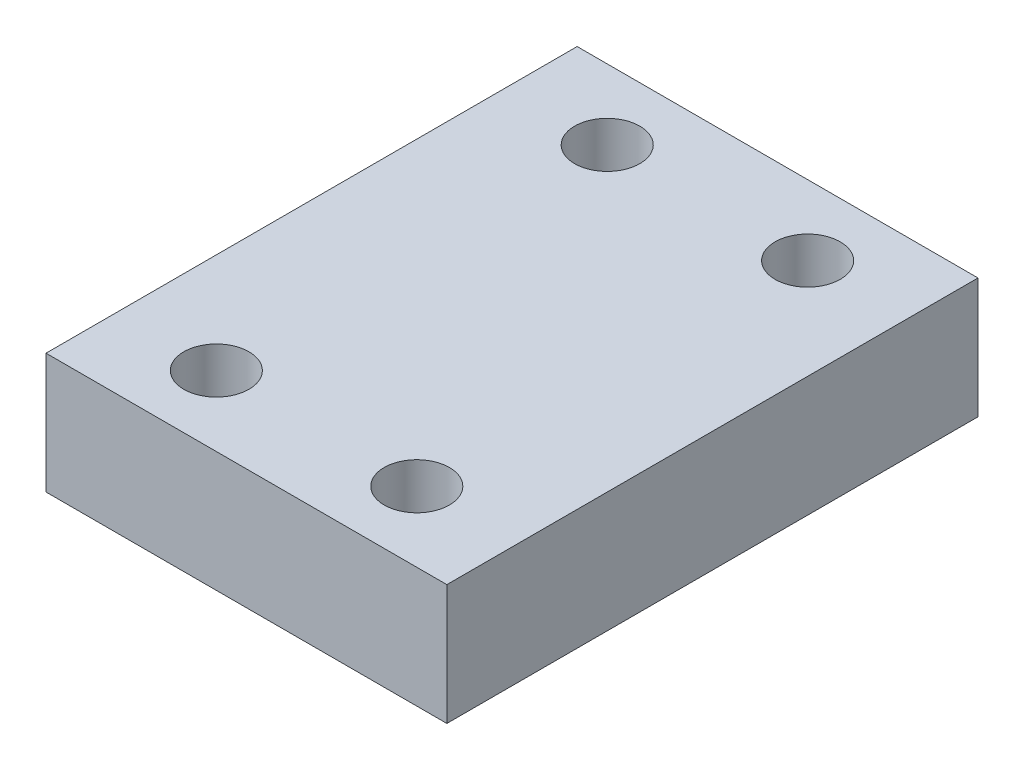
ISO-10303-21;
HEADER;
FILE_DESCRIPTION(('STEP AP214'),'2;1');
FILE_NAME('part.step','',(''),(''),'','','');
FILE_SCHEMA(('AUTOMOTIVE_DESIGN { 1 0 10303 214 1 1 1 1 }'));
ENDSEC;
DATA;
#1=APPLICATION_CONTEXT('core data for automotive mechanical design processes');
#2=APPLICATION_PROTOCOL_DEFINITION('international standard','automotive_design',2000,#1);
#3=PRODUCT_CONTEXT('',#1,'mechanical');
#4=PRODUCT('Part','Part','',(#3));
#5=PRODUCT_RELATED_PRODUCT_CATEGORY('part','',(#4));
#6=PRODUCT_DEFINITION_FORMATION('','',#4);
#7=PRODUCT_DEFINITION_CONTEXT('part definition',#1,'design');
#8=PRODUCT_DEFINITION('design','',#6,#7);
#9=PRODUCT_DEFINITION_SHAPE('','',#8);
#10=(LENGTH_UNIT() NAMED_UNIT(*) SI_UNIT(.MILLI.,.METRE.));
#11=(NAMED_UNIT(*) PLANE_ANGLE_UNIT() SI_UNIT($,.RADIAN.));
#12=(NAMED_UNIT(*) SI_UNIT($,.STERADIAN.) SOLID_ANGLE_UNIT());
#13=UNCERTAINTY_MEASURE_WITH_UNIT(LENGTH_MEASURE(1.E-05),#10,'distance_accuracy_value','');
#14=(GEOMETRIC_REPRESENTATION_CONTEXT(3) GLOBAL_UNCERTAINTY_ASSIGNED_CONTEXT((#13)) GLOBAL_UNIT_ASSIGNED_CONTEXT((#10,
#11,#12)) REPRESENTATION_CONTEXT('',''));
#15=CARTESIAN_POINT('',(0.,0.,0.));
#16=DIRECTION('',(0.,0.,1.));
#17=DIRECTION('',(1.,0.,0.));
#18=AXIS2_PLACEMENT_3D('',#15,#16,#17);
#19=CARTESIAN_POINT('',(22.4785493987858,12.,33.2413790928147));
#20=DIRECTION('',(-1.,0.,0.));
#21=DIRECTION('',(0.,0.,1.));
#22=AXIS2_PLACEMENT_3D('',#19,#20,#21);
#23=PLANE('',#22);
#24=DIRECTION('',(0.,0.,-1.));
#25=VECTOR('',#24,1.);
#26=CARTESIAN_POINT('',(22.4785493987858,0.,33.2413790928147));
#27=LINE('',#26,#25);
#28=CARTESIAN_POINT('',(22.4785493987858,0.,33.2413790928147));
#29=VERTEX_POINT('',#28);
#30=CARTESIAN_POINT('',(22.4785493987858,0.,-19.7586209071853));
#31=VERTEX_POINT('',#30);
#32=EDGE_CURVE('E100',#29,#31,#27,.T.);
#33=ORIENTED_EDGE('',*,*,#32,.T.);
#34=DIRECTION('',(0.,-1.,0.));
#35=VECTOR('',#34,1.);
#36=CARTESIAN_POINT('',(22.4785493987858,12.,-19.7586209071853));
#37=LINE('',#36,#35);
#38=CARTESIAN_POINT('',(22.4785493987858,12.,-19.7586209071853));
#39=VERTEX_POINT('',#38);
#40=EDGE_CURVE('E11',#39,#31,#37,.T.);
#41=ORIENTED_EDGE('',*,*,#40,.F.);
#42=DIRECTION('',(0.,0.,-1.));
#43=VECTOR('',#42,1.);
#44=CARTESIAN_POINT('',(22.4785493987858,12.,33.2413790928147));
#45=LINE('',#44,#43);
#46=CARTESIAN_POINT('',(22.4785493987858,12.,33.2413790928147));
#47=VERTEX_POINT('',#46);
#48=EDGE_CURVE('E88',#47,#39,#45,.T.);
#49=ORIENTED_EDGE('',*,*,#48,.F.);
#50=DIRECTION('',(0.,-1.,0.));
#51=VECTOR('',#50,1.);
#52=CARTESIAN_POINT('',(22.4785493987858,12.,33.2413790928147));
#53=LINE('',#52,#51);
#54=EDGE_CURVE('E96',#47,#29,#53,.T.);
#55=ORIENTED_EDGE('',*,*,#54,.T.);
#56=EDGE_LOOP('',(#33,#41,#49,#55));
#57=FACE_BOUND('',#56,.T.);
#58=ADVANCED_FACE('F37',(#57),#23,.F.);
#59=CARTESIAN_POINT('',(-17.5214506012142,12.,-19.7586209071853));
#60=DIRECTION('',(0.,0.,1.));
#61=DIRECTION('',(1.,0.,0.));
#62=AXIS2_PLACEMENT_3D('',#59,#60,#61);
#63=PLANE('',#62);
#64=DIRECTION('',(-1.,0.,0.));
#65=VECTOR('',#64,1.);
#66=CARTESIAN_POINT('',(-17.5214506012142,0.,-19.7586209071853));
#67=LINE('',#66,#65);
#68=CARTESIAN_POINT('',(-17.5214506012142,0.,-19.7586209071853));
#69=VERTEX_POINT('',#68);
#70=EDGE_CURVE('E92',#31,#69,#67,.T.);
#71=ORIENTED_EDGE('',*,*,#70,.T.);
#72=DIRECTION('',(0.,-1.,0.));
#73=VECTOR('',#72,1.);
#74=CARTESIAN_POINT('',(-17.5214506012142,12.,-19.7586209071853));
#75=LINE('',#74,#73);
#76=CARTESIAN_POINT('',(-17.5214506012142,12.,-19.7586209071853));
#77=VERTEX_POINT('',#76);
#78=EDGE_CURVE('E45',#77,#69,#75,.T.);
#79=ORIENTED_EDGE('',*,*,#78,.F.);
#80=DIRECTION('',(-1.,0.,0.));
#81=VECTOR('',#80,1.);
#82=CARTESIAN_POINT('',(-17.5214506012142,12.,-19.7586209071853));
#83=LINE('',#82,#81);
#84=EDGE_CURVE('E83',#39,#77,#83,.T.);
#85=ORIENTED_EDGE('',*,*,#84,.F.);
#86=ORIENTED_EDGE('',*,*,#40,.T.);
#87=EDGE_LOOP('',(#71,#79,#85,#86));
#88=FACE_BOUND('',#87,.T.);
#89=ADVANCED_FACE('F91',(#88),#63,.F.);
#90=CARTESIAN_POINT('',(-17.5214506012142,12.,33.2413790928147));
#91=DIRECTION('',(1.,0.,0.));
#92=DIRECTION('',(0.,0.,-1.));
#93=AXIS2_PLACEMENT_3D('',#90,#91,#92);
#94=PLANE('',#93);
#95=DIRECTION('',(0.,0.,1.));
#96=VECTOR('',#95,1.);
#97=CARTESIAN_POINT('',(-17.5214506012142,0.,33.2413790928147));
#98=LINE('',#97,#96);
#99=CARTESIAN_POINT('',(-17.5214506012142,0.,33.2413790928147));
#100=VERTEX_POINT('',#99);
#101=EDGE_CURVE('E70',#69,#100,#98,.T.);
#102=ORIENTED_EDGE('',*,*,#101,.T.);
#103=DIRECTION('',(0.,-1.,0.));
#104=VECTOR('',#103,1.);
#105=CARTESIAN_POINT('',(-17.5214506012142,12.,33.2413790928147));
#106=LINE('',#105,#104);
#107=CARTESIAN_POINT('',(-17.5214506012142,12.,33.2413790928147));
#108=VERTEX_POINT('',#107);
#109=EDGE_CURVE('E93',#108,#100,#106,.T.);
#110=ORIENTED_EDGE('',*,*,#109,.F.);
#111=DIRECTION('',(0.,0.,1.));
#112=VECTOR('',#111,1.);
#113=CARTESIAN_POINT('',(-17.5214506012142,12.,33.2413790928147));
#114=LINE('',#113,#112);
#115=EDGE_CURVE('E86',#77,#108,#114,.T.);
#116=ORIENTED_EDGE('',*,*,#115,.F.);
#117=ORIENTED_EDGE('',*,*,#78,.T.);
#118=EDGE_LOOP('',(#102,#110,#116,#117));
#119=FACE_BOUND('',#118,.T.);
#120=ADVANCED_FACE('F94',(#119),#94,.F.);
#121=CARTESIAN_POINT('',(-17.5214506012142,12.,33.2413790928147));
#122=DIRECTION('',(0.,0.,-1.));
#123=DIRECTION('',(-1.,0.,0.));
#124=AXIS2_PLACEMENT_3D('',#121,#122,#123);
#125=PLANE('',#124);
#126=DIRECTION('',(1.,0.,0.));
#127=VECTOR('',#126,1.);
#128=CARTESIAN_POINT('',(-17.5214506012142,0.,33.2413790928147));
#129=LINE('',#128,#127);
#130=EDGE_CURVE('E76',#100,#29,#129,.T.);
#131=ORIENTED_EDGE('',*,*,#130,.T.);
#132=ORIENTED_EDGE('',*,*,#54,.F.);
#133=DIRECTION('',(1.,0.,0.));
#134=VECTOR('',#133,1.);
#135=CARTESIAN_POINT('',(-17.5214506012142,12.,33.2413790928147));
#136=LINE('',#135,#134);
#137=EDGE_CURVE('E53',#108,#47,#136,.T.);
#138=ORIENTED_EDGE('',*,*,#137,.F.);
#139=ORIENTED_EDGE('',*,*,#109,.T.);
#140=EDGE_LOOP('',(#131,#132,#138,#139));
#141=FACE_BOUND('',#140,.T.);
#142=ADVANCED_FACE('F108',(#141),#125,.F.);
#143=CARTESIAN_POINT('',(0.,12.,0.));
#144=DIRECTION('',(0.,-1.,0.));
#145=DIRECTION('',(0.,0.,-1.));
#146=AXIS2_PLACEMENT_3D('',#143,#144,#145);
#147=PLANE('',#146);
#148=CARTESIAN_POINT('',(12.4785493987858,12.,26.2413790928147));
#149=DIRECTION('',(0.,1.,0.));
#150=DIRECTION('',(0.,0.,1.));
#151=AXIS2_PLACEMENT_3D('',#148,#149,#150);
#152=CIRCLE('',#151,3.25);
#153=CARTESIAN_POINT('',(12.4785493987858,12.,29.4913790928147));
#154=VERTEX_POINT('',#153);
#155=EDGE_CURVE('E129',#154,#154,#152,.T.);
#156=ORIENTED_EDGE('',*,*,#155,.F.);
#157=EDGE_LOOP('',(#156));
#158=FACE_BOUND('',#157,.T.);
#159=CARTESIAN_POINT('',(-7.52145060121415,12.,-12.7586209071853));
#160=DIRECTION('',(0.,1.,0.));
#161=DIRECTION('',(0.,0.,1.));
#162=AXIS2_PLACEMENT_3D('',#159,#160,#161);
#163=CIRCLE('',#162,3.25);
#164=CARTESIAN_POINT('',(-7.52145060121415,12.,-9.50862090718527));
#165=VERTEX_POINT('',#164);
#166=EDGE_CURVE('E135',#165,#165,#163,.T.);
#167=ORIENTED_EDGE('',*,*,#166,.F.);
#168=EDGE_LOOP('',(#167));
#169=FACE_BOUND('',#168,.T.);
#170=CARTESIAN_POINT('',(12.4785493987858,12.,-12.7586209071853));
#171=DIRECTION('',(0.,1.,0.));
#172=DIRECTION('',(0.,0.,1.));
#173=AXIS2_PLACEMENT_3D('',#170,#171,#172);
#174=CIRCLE('',#173,3.25);
#175=CARTESIAN_POINT('',(12.4785493987858,12.,-9.50862090718527));
#176=VERTEX_POINT('',#175);
#177=EDGE_CURVE('E136',#176,#176,#174,.T.);
#178=ORIENTED_EDGE('',*,*,#177,.F.);
#179=EDGE_LOOP('',(#178));
#180=FACE_BOUND('',#179,.T.);
#181=CARTESIAN_POINT('',(-7.52145060121415,12.,26.2413790928147));
#182=DIRECTION('',(0.,1.,0.));
#183=DIRECTION('',(0.,0.,1.));
#184=AXIS2_PLACEMENT_3D('',#181,#182,#183);
#185=CIRCLE('',#184,3.25);
#186=CARTESIAN_POINT('',(-7.52145060121415,12.,29.4913790928147));
#187=VERTEX_POINT('',#186);
#188=EDGE_CURVE('E123',#187,#187,#185,.T.);
#189=ORIENTED_EDGE('',*,*,#188,.F.);
#190=EDGE_LOOP('',(#189));
#191=FACE_BOUND('',#190,.T.);
#192=ORIENTED_EDGE('',*,*,#48,.T.);
#193=ORIENTED_EDGE('',*,*,#84,.T.);
#194=ORIENTED_EDGE('',*,*,#115,.T.);
#195=ORIENTED_EDGE('',*,*,#137,.T.);
#196=EDGE_LOOP('',(#192,#193,#194,#195));
#197=FACE_BOUND('',#196,.T.);
#198=ADVANCED_FACE('F84',(#158,#169,#180,#191,#197),#147,.F.);
#199=CARTESIAN_POINT('',(0.,0.,0.));
#200=DIRECTION('',(0.,-1.,0.));
#201=DIRECTION('',(0.,0.,-1.));
#202=AXIS2_PLACEMENT_3D('',#199,#200,#201);
#203=PLANE('',#202);
#204=CARTESIAN_POINT('',(12.4785493987858,0.,26.2413790928147));
#205=DIRECTION('',(0.,-1.,0.));
#206=DIRECTION('',(0.,0.,-1.));
#207=AXIS2_PLACEMENT_3D('',#204,#205,#206);
#208=CIRCLE('',#207,3.25);
#209=CARTESIAN_POINT('',(12.4785493987858,0.,22.9913790928147));
#210=VERTEX_POINT('',#209);
#211=EDGE_CURVE('E139',#210,#210,#208,.F.);
#212=ORIENTED_EDGE('',*,*,#211,.T.);
#213=EDGE_LOOP('',(#212));
#214=FACE_BOUND('',#213,.T.);
#215=CARTESIAN_POINT('',(-7.52145060121415,0.,-12.7586209071853));
#216=DIRECTION('',(0.,-1.,0.));
#217=DIRECTION('',(0.,0.,-1.));
#218=AXIS2_PLACEMENT_3D('',#215,#216,#217);
#219=CIRCLE('',#218,3.25);
#220=CARTESIAN_POINT('',(-7.52145060121415,0.,-16.0086209071853));
#221=VERTEX_POINT('',#220);
#222=EDGE_CURVE('E132',#221,#221,#219,.F.);
#223=ORIENTED_EDGE('',*,*,#222,.T.);
#224=EDGE_LOOP('',(#223));
#225=FACE_BOUND('',#224,.T.);
#226=CARTESIAN_POINT('',(12.4785493987858,0.,-12.7586209071853));
#227=DIRECTION('',(0.,-1.,0.));
#228=DIRECTION('',(0.,0.,-1.));
#229=AXIS2_PLACEMENT_3D('',#226,#227,#228);
#230=CIRCLE('',#229,3.25);
#231=CARTESIAN_POINT('',(12.4785493987858,0.,-16.0086209071853));
#232=VERTEX_POINT('',#231);
#233=EDGE_CURVE('E144',#232,#232,#230,.F.);
#234=ORIENTED_EDGE('',*,*,#233,.T.);
#235=EDGE_LOOP('',(#234));
#236=FACE_BOUND('',#235,.T.);
#237=CARTESIAN_POINT('',(-7.52145060121415,0.,26.2413790928147));
#238=DIRECTION('',(0.,-1.,0.));
#239=DIRECTION('',(0.,0.,-1.));
#240=AXIS2_PLACEMENT_3D('',#237,#238,#239);
#241=CIRCLE('',#240,3.25);
#242=CARTESIAN_POINT('',(-7.52145060121415,0.,22.9913790928147));
#243=VERTEX_POINT('',#242);
#244=EDGE_CURVE('E126',#243,#243,#241,.F.);
#245=ORIENTED_EDGE('',*,*,#244,.T.);
#246=EDGE_LOOP('',(#245));
#247=FACE_BOUND('',#246,.T.);
#248=CARTESIAN_POINT('',(2.47854939878584,0.,6.74137909281474));
#249=DIRECTION('',(0.,-1.,0.));
#250=DIRECTION('',(0.,0.,-1.));
#251=AXIS2_PLACEMENT_3D('',#248,#249,#250);
#252=CIRCLE('',#251,8.);
#253=CARTESIAN_POINT('',(2.47854939878584,0.,-1.25862090718526));
#254=VERTEX_POINT('',#253);
#255=EDGE_CURVE('E114',#254,#254,#252,.T.);
#256=ORIENTED_EDGE('',*,*,#255,.F.);
#257=EDGE_LOOP('',(#256));
#258=FACE_BOUND('',#257,.T.);
#259=ORIENTED_EDGE('',*,*,#32,.F.);
#260=ORIENTED_EDGE('',*,*,#130,.F.);
#261=ORIENTED_EDGE('',*,*,#101,.F.);
#262=ORIENTED_EDGE('',*,*,#70,.F.);
#263=EDGE_LOOP('',(#259,#260,#261,#262));
#264=FACE_BOUND('',#263,.T.);
#265=ADVANCED_FACE('F111',(#214,#225,#236,#247,#258,#264),#203,.T.);
#266=CARTESIAN_POINT('',(2.47854939878584,3.5,6.74137909281474));
#267=DIRECTION('',(0.,-1.,0.));
#268=DIRECTION('',(0.,0.,-1.));
#269=AXIS2_PLACEMENT_3D('',#266,#267,#268);
#270=CYLINDRICAL_SURFACE('',#269,8.);
#271=CARTESIAN_POINT('',(2.47854939878584,3.5,6.74137909281474));
#272=DIRECTION('',(0.,-1.,0.));
#273=DIRECTION('',(0.,0.,-1.));
#274=AXIS2_PLACEMENT_3D('',#271,#272,#273);
#275=CIRCLE('',#274,8.);
#276=CARTESIAN_POINT('',(2.47854939878584,3.5,-1.25862090718526));
#277=VERTEX_POINT('',#276);
#278=EDGE_CURVE('E103',#277,#277,#275,.T.);
#279=ORIENTED_EDGE('',*,*,#278,.F.);
#280=EDGE_LOOP('',(#279));
#281=FACE_BOUND('',#280,.T.);
#282=ORIENTED_EDGE('',*,*,#255,.T.);
#283=EDGE_LOOP('',(#282));
#284=FACE_BOUND('',#283,.T.);
#285=ADVANCED_FACE('F187',(#281,#284),#270,.F.);
#286=CARTESIAN_POINT('',(2.47854939878584,3.5,6.74137909281474));
#287=DIRECTION('',(0.,-1.,0.));
#288=DIRECTION('',(0.,0.,-1.));
#289=AXIS2_PLACEMENT_3D('',#286,#287,#288);
#290=PLANE('',#289);
#291=CARTESIAN_POINT('',(2.47854939878584,3.5,6.74137909281474));
#292=DIRECTION('',(0.,-1.,0.));
#293=DIRECTION('',(0.,0.,-1.));
#294=AXIS2_PLACEMENT_3D('',#291,#292,#293);
#295=CIRCLE('',#294,4.25);
#296=CARTESIAN_POINT('',(2.47854939878584,3.5,2.49137909281474));
#297=VERTEX_POINT('',#296);
#298=EDGE_CURVE('E120',#297,#297,#295,.T.);
#299=ORIENTED_EDGE('',*,*,#298,.F.);
#300=EDGE_LOOP('',(#299));
#301=FACE_BOUND('',#300,.T.);
#302=ORIENTED_EDGE('',*,*,#278,.T.);
#303=EDGE_LOOP('',(#302));
#304=FACE_BOUND('',#303,.T.);
#305=ADVANCED_FACE('F192',(#301,#304),#290,.T.);
#306=CARTESIAN_POINT('',(2.47854939878584,5.,6.74137909281474));
#307=DIRECTION('',(0.,-1.,0.));
#308=DIRECTION('',(0.,0.,-1.));
#309=AXIS2_PLACEMENT_3D('',#306,#307,#308);
#310=CYLINDRICAL_SURFACE('',#309,4.25);
#311=CARTESIAN_POINT('',(2.47854939878584,5.,6.74137909281474));
#312=DIRECTION('',(0.,-1.,0.));
#313=DIRECTION('',(0.,0.,-1.));
#314=AXIS2_PLACEMENT_3D('',#311,#312,#313);
#315=CIRCLE('',#314,4.25);
#316=CARTESIAN_POINT('',(2.47854939878584,5.,2.49137909281474));
#317=VERTEX_POINT('',#316);
#318=EDGE_CURVE('E117',#317,#317,#315,.T.);
#319=ORIENTED_EDGE('',*,*,#318,.F.);
#320=EDGE_LOOP('',(#319));
#321=FACE_BOUND('',#320,.T.);
#322=ORIENTED_EDGE('',*,*,#298,.T.);
#323=EDGE_LOOP('',(#322));
#324=FACE_BOUND('',#323,.T.);
#325=ADVANCED_FACE('F170',(#321,#324),#310,.F.);
#326=CARTESIAN_POINT('',(2.47854939878584,5.,6.74137909281474));
#327=DIRECTION('',(0.,-1.,0.));
#328=DIRECTION('',(0.,0.,-1.));
#329=AXIS2_PLACEMENT_3D('',#326,#327,#328);
#330=PLANE('',#329);
#331=ORIENTED_EDGE('',*,*,#318,.T.);
#332=EDGE_LOOP('',(#331));
#333=FACE_BOUND('',#332,.T.);
#334=ADVANCED_FACE('F160',(#333),#330,.T.);
#335=CARTESIAN_POINT('',(-7.52145060121415,-0.000999999999999265,26.2413790928147));
#336=DIRECTION('',(0.,1.,0.));
#337=DIRECTION('',(0.,0.,1.));
#338=AXIS2_PLACEMENT_3D('',#335,#336,#337);
#339=CYLINDRICAL_SURFACE('',#338,3.25);
#340=ORIENTED_EDGE('',*,*,#244,.F.);
#341=EDGE_LOOP('',(#340));
#342=FACE_BOUND('',#341,.T.);
#343=ORIENTED_EDGE('',*,*,#188,.T.);
#344=EDGE_LOOP('',(#343));
#345=FACE_BOUND('',#344,.T.);
#346=ADVANCED_FACE('F158',(#342,#345),#339,.F.);
#347=CARTESIAN_POINT('',(12.4785493987858,-0.000999999999999265,-12.7586209071853));
#348=DIRECTION('',(0.,1.,0.));
#349=DIRECTION('',(0.,0.,1.));
#350=AXIS2_PLACEMENT_3D('',#347,#348,#349);
#351=CYLINDRICAL_SURFACE('',#350,3.25);
#352=ORIENTED_EDGE('',*,*,#233,.F.);
#353=EDGE_LOOP('',(#352));
#354=FACE_BOUND('',#353,.T.);
#355=ORIENTED_EDGE('',*,*,#177,.T.);
#356=EDGE_LOOP('',(#355));
#357=FACE_BOUND('',#356,.T.);
#358=ADVANCED_FACE('F150',(#354,#357),#351,.F.);
#359=CARTESIAN_POINT('',(-7.52145060121415,-0.000999999999999265,-12.7586209071853));
#360=DIRECTION('',(0.,1.,0.));
#361=DIRECTION('',(0.,0.,1.));
#362=AXIS2_PLACEMENT_3D('',#359,#360,#361);
#363=CYLINDRICAL_SURFACE('',#362,3.25);
#364=ORIENTED_EDGE('',*,*,#222,.F.);
#365=EDGE_LOOP('',(#364));
#366=FACE_BOUND('',#365,.T.);
#367=ORIENTED_EDGE('',*,*,#166,.T.);
#368=EDGE_LOOP('',(#367));
#369=FACE_BOUND('',#368,.T.);
#370=ADVANCED_FACE('F167',(#366,#369),#363,.F.);
#371=CARTESIAN_POINT('',(12.4785493987858,-0.000999999999999265,26.2413790928147));
#372=DIRECTION('',(0.,1.,0.));
#373=DIRECTION('',(0.,0.,1.));
#374=AXIS2_PLACEMENT_3D('',#371,#372,#373);
#375=CYLINDRICAL_SURFACE('',#374,3.25);
#376=ORIENTED_EDGE('',*,*,#211,.F.);
#377=EDGE_LOOP('',(#376));
#378=FACE_BOUND('',#377,.T.);
#379=ORIENTED_EDGE('',*,*,#155,.T.);
#380=EDGE_LOOP('',(#379));
#381=FACE_BOUND('',#380,.T.);
#382=ADVANCED_FACE('F248',(#378,#381),#375,.F.);
#383=CLOSED_SHELL('',(#58,#89,#120,#142,#198,#265,#285,#305,#325,#334,#346,#358,#370,#382));
#384=MANIFOLD_SOLID_BREP('B2',#383);
#385=ADVANCED_BREP_SHAPE_REPRESENTATION('',(#18,#384),#14);
#386=SHAPE_DEFINITION_REPRESENTATION(#9,#385);
ENDSEC;
END-ISO-10303-21;
